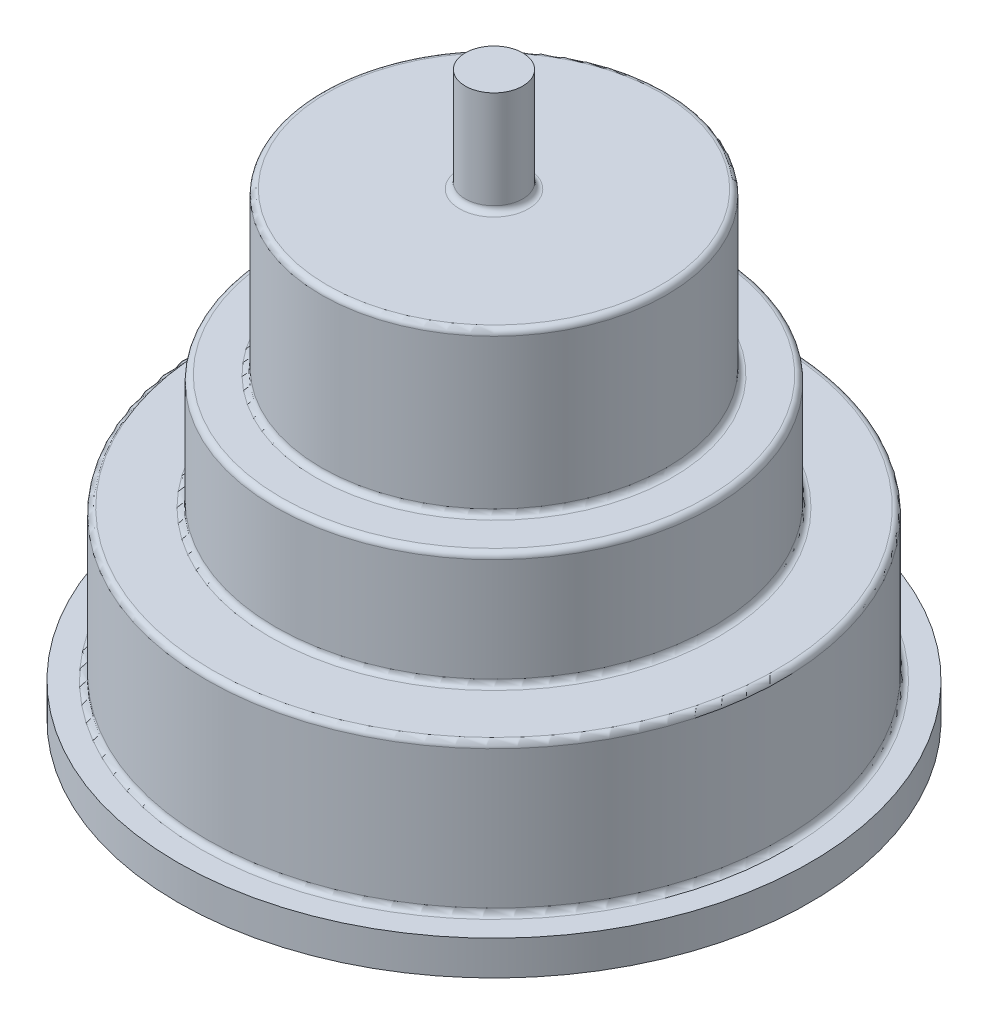
ISO-10303-21;
HEADER;
FILE_DESCRIPTION(('STEP AP214'),'2;1');
FILE_NAME('part.step','',(''),(''),'','','');
FILE_SCHEMA(('AUTOMOTIVE_DESIGN { 1 0 10303 214 1 1 1 1 }'));
ENDSEC;
DATA;
#1=APPLICATION_CONTEXT('core data for automotive mechanical design processes');
#2=APPLICATION_PROTOCOL_DEFINITION('international standard','automotive_design',2000,#1);
#3=PRODUCT_CONTEXT('',#1,'mechanical');
#4=PRODUCT('Part','Part','',(#3));
#5=PRODUCT_RELATED_PRODUCT_CATEGORY('part','',(#4));
#6=PRODUCT_DEFINITION_FORMATION('','',#4);
#7=PRODUCT_DEFINITION_CONTEXT('part definition',#1,'design');
#8=PRODUCT_DEFINITION('design','',#6,#7);
#9=PRODUCT_DEFINITION_SHAPE('','',#8);
#10=(LENGTH_UNIT() NAMED_UNIT(*) SI_UNIT(.MILLI.,.METRE.));
#11=(NAMED_UNIT(*) PLANE_ANGLE_UNIT() SI_UNIT($,.RADIAN.));
#12=(NAMED_UNIT(*) SI_UNIT($,.STERADIAN.) SOLID_ANGLE_UNIT());
#13=UNCERTAINTY_MEASURE_WITH_UNIT(LENGTH_MEASURE(1.E-05),#10,'distance_accuracy_value','');
#14=(GEOMETRIC_REPRESENTATION_CONTEXT(3) GLOBAL_UNCERTAINTY_ASSIGNED_CONTEXT((#13)) GLOBAL_UNIT_ASSIGNED_CONTEXT((#10,
#11,#12)) REPRESENTATION_CONTEXT('',''));
#15=CARTESIAN_POINT('',(0.,0.,0.));
#16=DIRECTION('',(0.,0.,1.));
#17=DIRECTION('',(1.,0.,0.));
#18=AXIS2_PLACEMENT_3D('',#15,#16,#17);
#19=CARTESIAN_POINT('',(0.,26.,0.));
#20=DIRECTION('',(0.,-1.,0.));
#21=DIRECTION('',(0.,0.,-1.));
#22=AXIS2_PLACEMENT_3D('',#19,#20,#21);
#23=CYLINDRICAL_SURFACE('',#22,25.);
#24=CARTESIAN_POINT('',(0.,15.5,0.));
#25=DIRECTION('',(0.,1.,0.));
#26=DIRECTION('',(0.,0.,1.));
#27=AXIS2_PLACEMENT_3D('',#24,#25,#26);
#28=CIRCLE('',#27,25.);
#29=CARTESIAN_POINT('',(0.,15.5,25.));
#30=VERTEX_POINT('',#29);
#31=EDGE_CURVE('E136',#30,#30,#28,.F.);
#32=ORIENTED_EDGE('',*,*,#31,.T.);
#33=EDGE_LOOP('',(#32));
#34=FACE_BOUND('',#33,.T.);
#35=CARTESIAN_POINT('',(0.,3.5,0.));
#36=DIRECTION('',(0.,1.,0.));
#37=DIRECTION('',(0.,0.,1.));
#38=AXIS2_PLACEMENT_3D('',#35,#36,#37);
#39=CIRCLE('',#38,25.);
#40=CARTESIAN_POINT('',(0.,3.5,25.));
#41=VERTEX_POINT('',#40);
#42=EDGE_CURVE('E133',#41,#41,#39,.T.);
#43=ORIENTED_EDGE('',*,*,#42,.T.);
#44=EDGE_LOOP('',(#43));
#45=FACE_BOUND('',#44,.T.);
#46=ADVANCED_FACE('F40',(#34,#45),#23,.T.);
#47=CARTESIAN_POINT('',(0.,3.,0.));
#48=DIRECTION('',(0.,-1.,0.));
#49=DIRECTION('',(0.,0.,-1.));
#50=AXIS2_PLACEMENT_3D('',#47,#48,#49);
#51=CYLINDRICAL_SURFACE('',#50,27.5);
#52=CARTESIAN_POINT('',(0.,3.,0.));
#53=DIRECTION('',(0.,1.,0.));
#54=DIRECTION('',(0.,0.,1.));
#55=AXIS2_PLACEMENT_3D('',#52,#53,#54);
#56=CIRCLE('',#55,27.5);
#57=CARTESIAN_POINT('',(0.,3.,27.5));
#58=VERTEX_POINT('',#57);
#59=EDGE_CURVE('E98',#58,#58,#56,.T.);
#60=ORIENTED_EDGE('',*,*,#59,.F.);
#61=EDGE_LOOP('',(#60));
#62=FACE_BOUND('',#61,.T.);
#63=CARTESIAN_POINT('',(0.,0.,0.));
#64=DIRECTION('',(0.,1.,0.));
#65=DIRECTION('',(0.,0.,1.));
#66=AXIS2_PLACEMENT_3D('',#63,#64,#65);
#67=CIRCLE('',#66,27.5);
#68=CARTESIAN_POINT('',(0.,0.,27.5));
#69=VERTEX_POINT('',#68);
#70=EDGE_CURVE('E97',#69,#69,#67,.T.);
#71=ORIENTED_EDGE('',*,*,#70,.T.);
#72=EDGE_LOOP('',(#71));
#73=FACE_BOUND('',#72,.T.);
#74=ADVANCED_FACE('F153',(#62,#73),#51,.T.);
#75=CARTESIAN_POINT('',(0.,3.,0.));
#76=DIRECTION('',(0.,1.,0.));
#77=DIRECTION('',(0.,0.,1.));
#78=AXIS2_PLACEMENT_3D('',#75,#76,#77);
#79=PLANE('',#78);
#80=CARTESIAN_POINT('',(0.,3.,0.));
#81=DIRECTION('',(0.,1.,0.));
#82=DIRECTION('',(0.,0.,1.));
#83=AXIS2_PLACEMENT_3D('',#80,#81,#82);
#84=CIRCLE('',#83,25.5);
#85=CARTESIAN_POINT('',(0.,3.,25.5));
#86=VERTEX_POINT('',#85);
#87=EDGE_CURVE('E48',#86,#86,#84,.F.);
#88=ORIENTED_EDGE('',*,*,#87,.T.);
#89=EDGE_LOOP('',(#88));
#90=FACE_BOUND('',#89,.T.);
#91=ORIENTED_EDGE('',*,*,#59,.T.);
#92=EDGE_LOOP('',(#91));
#93=FACE_BOUND('',#92,.T.);
#94=ADVANCED_FACE('F141',(#90,#93),#79,.T.);
#95=CARTESIAN_POINT('',(0.,0.,0.));
#96=DIRECTION('',(0.,1.,0.));
#97=DIRECTION('',(0.,0.,1.));
#98=AXIS2_PLACEMENT_3D('',#95,#96,#97);
#99=PLANE('',#98);
#100=CARTESIAN_POINT('',(0.,0.,17.));
#101=DIRECTION('',(0.,-1.,0.));
#102=DIRECTION('',(0.,0.,-1.));
#103=AXIS2_PLACEMENT_3D('',#100,#101,#102);
#104=CIRCLE('',#103,1.64999999999999);
#105=CARTESIAN_POINT('',(0.,0.,15.35));
#106=VERTEX_POINT('',#105);
#107=EDGE_CURVE('E72',#106,#106,#104,.T.);
#108=ORIENTED_EDGE('',*,*,#107,.F.);
#109=EDGE_LOOP('',(#108));
#110=FACE_BOUND('',#109,.T.);
#111=CARTESIAN_POINT('',(17.,0.,0.));
#112=DIRECTION('',(0.,-1.,0.));
#113=DIRECTION('',(0.,0.,-1.));
#114=AXIS2_PLACEMENT_3D('',#111,#112,#113);
#115=CIRCLE('',#114,1.64999999999999);
#116=CARTESIAN_POINT('',(17.,0.,-1.64999999999999));
#117=VERTEX_POINT('',#116);
#118=EDGE_CURVE('E71',#117,#117,#115,.T.);
#119=ORIENTED_EDGE('',*,*,#118,.F.);
#120=EDGE_LOOP('',(#119));
#121=FACE_BOUND('',#120,.T.);
#122=CARTESIAN_POINT('',(0.,0.,-17.));
#123=DIRECTION('',(0.,-1.,0.));
#124=DIRECTION('',(0.,0.,-1.));
#125=AXIS2_PLACEMENT_3D('',#122,#123,#124);
#126=CIRCLE('',#125,1.64999999999999);
#127=CARTESIAN_POINT('',(0.,0.,-18.65));
#128=VERTEX_POINT('',#127);
#129=EDGE_CURVE('E82',#128,#128,#126,.T.);
#130=ORIENTED_EDGE('',*,*,#129,.F.);
#131=EDGE_LOOP('',(#130));
#132=FACE_BOUND('',#131,.T.);
#133=CARTESIAN_POINT('',(-17.,0.,0.));
#134=DIRECTION('',(0.,-1.,0.));
#135=DIRECTION('',(0.,0.,-1.));
#136=AXIS2_PLACEMENT_3D('',#133,#134,#135);
#137=CIRCLE('',#136,1.64999999999999);
#138=CARTESIAN_POINT('',(-17.,0.,-1.64999999999999));
#139=VERTEX_POINT('',#138);
#140=EDGE_CURVE('E88',#139,#139,#137,.T.);
#141=ORIENTED_EDGE('',*,*,#140,.F.);
#142=EDGE_LOOP('',(#141));
#143=FACE_BOUND('',#142,.T.);
#144=ORIENTED_EDGE('',*,*,#70,.F.);
#145=EDGE_LOOP('',(#144));
#146=FACE_BOUND('',#145,.T.);
#147=ADVANCED_FACE('F167',(#110,#121,#132,#143,#146),#99,.F.);
#148=CARTESIAN_POINT('',(-17.,11.,0.));
#149=DIRECTION('',(0.,-1.,0.));
#150=DIRECTION('',(0.,0.,-1.));
#151=AXIS2_PLACEMENT_3D('',#148,#149,#150);
#152=CONICAL_SURFACE('',#151,1.65,1.02974425867665);
#153=CARTESIAN_POINT('',(-17.,11.9914200213955,0.));
#154=VERTEX_POINT('',#153);
#155=VERTEX_LOOP('',#154);
#156=FACE_BOUND('',#155,.T.);
#157=CARTESIAN_POINT('',(-17.,11.,0.));
#158=DIRECTION('',(0.,-1.,0.));
#159=DIRECTION('',(0.,0.,-1.));
#160=AXIS2_PLACEMENT_3D('',#157,#158,#159);
#161=CIRCLE('',#160,1.65);
#162=CARTESIAN_POINT('',(-17.,11.,-1.65));
#163=VERTEX_POINT('',#162);
#164=EDGE_CURVE('E91',#163,#163,#161,.T.);
#165=ORIENTED_EDGE('',*,*,#164,.T.);
#166=EDGE_LOOP('',(#165));
#167=FACE_BOUND('',#166,.T.);
#168=ADVANCED_FACE('F169',(#156,#167),#152,.F.);
#169=CARTESIAN_POINT('',(-17.,0.,0.));
#170=DIRECTION('',(0.,-1.,0.));
#171=DIRECTION('',(0.,0.,-1.));
#172=AXIS2_PLACEMENT_3D('',#169,#170,#171);
#173=CYLINDRICAL_SURFACE('',#172,1.64999999999999);
#174=ORIENTED_EDGE('',*,*,#164,.F.);
#175=EDGE_LOOP('',(#174));
#176=FACE_BOUND('',#175,.T.);
#177=ORIENTED_EDGE('',*,*,#140,.T.);
#178=EDGE_LOOP('',(#177));
#179=FACE_BOUND('',#178,.T.);
#180=ADVANCED_FACE('F219',(#176,#179),#173,.F.);
#181=CARTESIAN_POINT('',(0.,11.,-17.));
#182=DIRECTION('',(0.,-1.,0.));
#183=DIRECTION('',(0.,0.,-1.));
#184=AXIS2_PLACEMENT_3D('',#181,#182,#183);
#185=CONICAL_SURFACE('',#184,1.65,1.02974425867665);
#186=CARTESIAN_POINT('',(0.,11.9914200213955,-17.));
#187=VERTEX_POINT('',#186);
#188=VERTEX_LOOP('',#187);
#189=FACE_BOUND('',#188,.T.);
#190=CARTESIAN_POINT('',(0.,11.,-17.));
#191=DIRECTION('',(0.,-1.,0.));
#192=DIRECTION('',(0.,0.,-1.));
#193=AXIS2_PLACEMENT_3D('',#190,#191,#192);
#194=CIRCLE('',#193,1.65);
#195=CARTESIAN_POINT('',(0.,11.,-18.65));
#196=VERTEX_POINT('',#195);
#197=EDGE_CURVE('E85',#196,#196,#194,.T.);
#198=ORIENTED_EDGE('',*,*,#197,.T.);
#199=EDGE_LOOP('',(#198));
#200=FACE_BOUND('',#199,.T.);
#201=ADVANCED_FACE('F222',(#189,#200),#185,.F.);
#202=CARTESIAN_POINT('',(0.,0.,-17.));
#203=DIRECTION('',(0.,-1.,0.));
#204=DIRECTION('',(0.,0.,-1.));
#205=AXIS2_PLACEMENT_3D('',#202,#203,#204);
#206=CYLINDRICAL_SURFACE('',#205,1.64999999999999);
#207=ORIENTED_EDGE('',*,*,#197,.F.);
#208=EDGE_LOOP('',(#207));
#209=FACE_BOUND('',#208,.T.);
#210=ORIENTED_EDGE('',*,*,#129,.T.);
#211=EDGE_LOOP('',(#210));
#212=FACE_BOUND('',#211,.T.);
#213=ADVANCED_FACE('F226',(#209,#212),#206,.F.);
#214=CARTESIAN_POINT('',(17.,11.,0.));
#215=DIRECTION('',(0.,-1.,0.));
#216=DIRECTION('',(0.,0.,-1.));
#217=AXIS2_PLACEMENT_3D('',#214,#215,#216);
#218=CONICAL_SURFACE('',#217,1.65,1.02974425867665);
#219=CARTESIAN_POINT('',(17.,11.9914200213955,0.));
#220=VERTEX_POINT('',#219);
#221=VERTEX_LOOP('',#220);
#222=FACE_BOUND('',#221,.T.);
#223=CARTESIAN_POINT('',(17.,11.,0.));
#224=DIRECTION('',(0.,-1.,0.));
#225=DIRECTION('',(0.,0.,-1.));
#226=AXIS2_PLACEMENT_3D('',#223,#224,#225);
#227=CIRCLE('',#226,1.65);
#228=CARTESIAN_POINT('',(17.,11.,-1.65));
#229=VERTEX_POINT('',#228);
#230=EDGE_CURVE('E75',#229,#229,#227,.T.);
#231=ORIENTED_EDGE('',*,*,#230,.T.);
#232=EDGE_LOOP('',(#231));
#233=FACE_BOUND('',#232,.T.);
#234=ADVANCED_FACE('F229',(#222,#233),#218,.F.);
#235=CARTESIAN_POINT('',(17.,0.,0.));
#236=DIRECTION('',(0.,-1.,0.));
#237=DIRECTION('',(0.,0.,-1.));
#238=AXIS2_PLACEMENT_3D('',#235,#236,#237);
#239=CYLINDRICAL_SURFACE('',#238,1.65);
#240=ORIENTED_EDGE('',*,*,#230,.F.);
#241=EDGE_LOOP('',(#240));
#242=FACE_BOUND('',#241,.T.);
#243=ORIENTED_EDGE('',*,*,#118,.T.);
#244=EDGE_LOOP('',(#243));
#245=FACE_BOUND('',#244,.T.);
#246=ADVANCED_FACE('F65',(#242,#245),#239,.F.);
#247=CARTESIAN_POINT('',(0.,11.,17.));
#248=DIRECTION('',(0.,-1.,0.));
#249=DIRECTION('',(0.,0.,-1.));
#250=AXIS2_PLACEMENT_3D('',#247,#248,#249);
#251=CONICAL_SURFACE('',#250,1.65,1.02974425867665);
#252=CARTESIAN_POINT('',(0.,11.9914200213955,17.));
#253=VERTEX_POINT('',#252);
#254=VERTEX_LOOP('',#253);
#255=FACE_BOUND('',#254,.T.);
#256=CARTESIAN_POINT('',(0.,11.,17.));
#257=DIRECTION('',(0.,-1.,0.));
#258=DIRECTION('',(0.,0.,-1.));
#259=AXIS2_PLACEMENT_3D('',#256,#257,#258);
#260=CIRCLE('',#259,1.65);
#261=CARTESIAN_POINT('',(0.,11.,15.35));
#262=VERTEX_POINT('',#261);
#263=EDGE_CURVE('E69',#262,#262,#260,.T.);
#264=ORIENTED_EDGE('',*,*,#263,.T.);
#265=EDGE_LOOP('',(#264));
#266=FACE_BOUND('',#265,.T.);
#267=ADVANCED_FACE('F61',(#255,#266),#251,.F.);
#268=CARTESIAN_POINT('',(0.,0.,17.));
#269=DIRECTION('',(0.,-1.,0.));
#270=DIRECTION('',(0.,0.,-1.));
#271=AXIS2_PLACEMENT_3D('',#268,#269,#270);
#272=CYLINDRICAL_SURFACE('',#271,1.64999999999999);
#273=ORIENTED_EDGE('',*,*,#263,.F.);
#274=EDGE_LOOP('',(#273));
#275=FACE_BOUND('',#274,.T.);
#276=ORIENTED_EDGE('',*,*,#107,.T.);
#277=EDGE_LOOP('',(#276));
#278=FACE_BOUND('',#277,.T.);
#279=ADVANCED_FACE('F64',(#275,#278),#272,.F.);
#280=CARTESIAN_POINT('',(0.,-67.7106781186548,0.));
#281=DIRECTION('',(0.,1.,0.));
#282=DIRECTION('',(0.,0.,1.));
#283=AXIS2_PLACEMENT_3D('',#280,#281,#282);
#284=CYLINDRICAL_SURFACE('',#283,19.);
#285=CARTESIAN_POINT('',(0.,16.5,0.));
#286=DIRECTION('',(0.,1.,0.));
#287=DIRECTION('',(0.,0.,1.));
#288=AXIS2_PLACEMENT_3D('',#285,#286,#287);
#289=CIRCLE('',#288,19.);
#290=CARTESIAN_POINT('',(0.,16.5,19.));
#291=VERTEX_POINT('',#290);
#292=EDGE_CURVE('E112',#291,#291,#289,.T.);
#293=ORIENTED_EDGE('',*,*,#292,.T.);
#294=EDGE_LOOP('',(#293));
#295=FACE_BOUND('',#294,.T.);
#296=CARTESIAN_POINT('',(0.,25.5,0.));
#297=DIRECTION('',(0.,1.,0.));
#298=DIRECTION('',(0.,0.,1.));
#299=AXIS2_PLACEMENT_3D('',#296,#297,#298);
#300=CIRCLE('',#299,19.);
#301=CARTESIAN_POINT('',(0.,25.5,19.));
#302=VERTEX_POINT('',#301);
#303=EDGE_CURVE('E109',#302,#302,#300,.F.);
#304=ORIENTED_EDGE('',*,*,#303,.T.);
#305=EDGE_LOOP('',(#304));
#306=FACE_BOUND('',#305,.T.);
#307=ADVANCED_FACE('F239',(#295,#306),#284,.T.);
#308=CARTESIAN_POINT('',(0.,16.,0.));
#309=DIRECTION('',(0.,1.,0.));
#310=DIRECTION('',(0.,0.,1.));
#311=AXIS2_PLACEMENT_3D('',#308,#309,#310);
#312=PLANE('',#311);
#313=CARTESIAN_POINT('',(0.,16.,0.));
#314=DIRECTION('',(0.,1.,0.));
#315=DIRECTION('',(0.,0.,1.));
#316=AXIS2_PLACEMENT_3D('',#313,#314,#315);
#317=CIRCLE('',#316,19.5);
#318=CARTESIAN_POINT('',(0.,16.,19.5));
#319=VERTEX_POINT('',#318);
#320=EDGE_CURVE('E106',#319,#319,#317,.F.);
#321=ORIENTED_EDGE('',*,*,#320,.T.);
#322=EDGE_LOOP('',(#321));
#323=FACE_BOUND('',#322,.T.);
#324=CARTESIAN_POINT('',(0.,16.,0.));
#325=DIRECTION('',(0.,1.,0.));
#326=DIRECTION('',(0.,0.,1.));
#327=AXIS2_PLACEMENT_3D('',#324,#325,#326);
#328=CIRCLE('',#327,24.5);
#329=CARTESIAN_POINT('',(0.,16.,24.5));
#330=VERTEX_POINT('',#329);
#331=EDGE_CURVE('E101',#330,#330,#328,.T.);
#332=ORIENTED_EDGE('',*,*,#331,.T.);
#333=EDGE_LOOP('',(#332));
#334=FACE_BOUND('',#333,.T.);
#335=ADVANCED_FACE('F215',(#323,#334),#312,.T.);
#336=CARTESIAN_POINT('',(0.,49.,0.));
#337=DIRECTION('',(0.,1.,0.));
#338=DIRECTION('',(0.,0.,1.));
#339=AXIS2_PLACEMENT_3D('',#336,#337,#338);
#340=PLANE('',#339);
#341=CARTESIAN_POINT('',(0.,49.,0.));
#342=DIRECTION('',(0.,1.,0.));
#343=DIRECTION('',(0.,0.,1.));
#344=AXIS2_PLACEMENT_3D('',#341,#342,#343);
#345=CIRCLE('',#344,2.5);
#346=CARTESIAN_POINT('',(0.,49.,2.5));
#347=VERTEX_POINT('',#346);
#348=EDGE_CURVE('E94',#347,#347,#345,.T.);
#349=ORIENTED_EDGE('',*,*,#348,.T.);
#350=EDGE_LOOP('',(#349));
#351=FACE_BOUND('',#350,.T.);
#352=ADVANCED_FACE('F211',(#351),#340,.T.);
#353=CARTESIAN_POINT('',(0.,49.,0.));
#354=DIRECTION('',(0.,-1.,0.));
#355=DIRECTION('',(0.,0.,-1.));
#356=AXIS2_PLACEMENT_3D('',#353,#354,#355);
#357=CYLINDRICAL_SURFACE('',#356,2.5);
#358=CARTESIAN_POINT('',(0.,40.5,0.));
#359=DIRECTION('',(0.,1.,0.));
#360=DIRECTION('',(0.,0.,1.));
#361=AXIS2_PLACEMENT_3D('',#358,#359,#360);
#362=CIRCLE('',#361,2.5);
#363=CARTESIAN_POINT('',(0.,40.5,2.5));
#364=VERTEX_POINT('',#363);
#365=EDGE_CURVE('E13',#364,#364,#362,.T.);
#366=ORIENTED_EDGE('',*,*,#365,.T.);
#367=EDGE_LOOP('',(#366));
#368=FACE_BOUND('',#367,.T.);
#369=ORIENTED_EDGE('',*,*,#348,.F.);
#370=EDGE_LOOP('',(#369));
#371=FACE_BOUND('',#370,.T.);
#372=ADVANCED_FACE('F205',(#368,#371),#357,.T.);
#373=CARTESIAN_POINT('',(0.,40.,0.));
#374=DIRECTION('',(0.,1.,0.));
#375=DIRECTION('',(0.,0.,1.));
#376=AXIS2_PLACEMENT_3D('',#373,#374,#375);
#377=PLANE('',#376);
#378=CARTESIAN_POINT('',(0.,40.,0.));
#379=DIRECTION('',(0.,1.,0.));
#380=DIRECTION('',(0.,0.,1.));
#381=AXIS2_PLACEMENT_3D('',#378,#379,#380);
#382=CIRCLE('',#381,14.5);
#383=CARTESIAN_POINT('',(0.,40.,14.5));
#384=VERTEX_POINT('',#383);
#385=EDGE_CURVE('E118',#384,#384,#382,.T.);
#386=ORIENTED_EDGE('',*,*,#385,.T.);
#387=EDGE_LOOP('',(#386));
#388=FACE_BOUND('',#387,.T.);
#389=CARTESIAN_POINT('',(0.,40.,0.));
#390=DIRECTION('',(0.,1.,0.));
#391=DIRECTION('',(0.,0.,1.));
#392=AXIS2_PLACEMENT_3D('',#389,#390,#391);
#393=CIRCLE('',#392,3.);
#394=CARTESIAN_POINT('',(0.,40.,3.));
#395=VERTEX_POINT('',#394);
#396=EDGE_CURVE('E115',#395,#395,#393,.F.);
#397=ORIENTED_EDGE('',*,*,#396,.T.);
#398=EDGE_LOOP('',(#397));
#399=FACE_BOUND('',#398,.T.);
#400=ADVANCED_FACE('F198',(#388,#399),#377,.T.);
#401=CARTESIAN_POINT('',(0.,40.,0.));
#402=DIRECTION('',(0.,-1.,0.));
#403=DIRECTION('',(0.,0.,-1.));
#404=AXIS2_PLACEMENT_3D('',#401,#402,#403);
#405=CYLINDRICAL_SURFACE('',#404,15.);
#406=CARTESIAN_POINT('',(0.,39.5,0.));
#407=DIRECTION('',(0.,1.,0.));
#408=DIRECTION('',(0.,0.,1.));
#409=AXIS2_PLACEMENT_3D('',#406,#407,#408);
#410=CIRCLE('',#409,15.);
#411=CARTESIAN_POINT('',(0.,39.5,15.));
#412=VERTEX_POINT('',#411);
#413=EDGE_CURVE('E124',#412,#412,#410,.F.);
#414=ORIENTED_EDGE('',*,*,#413,.T.);
#415=EDGE_LOOP('',(#414));
#416=FACE_BOUND('',#415,.T.);
#417=CARTESIAN_POINT('',(0.,26.5,0.));
#418=DIRECTION('',(0.,1.,0.));
#419=DIRECTION('',(0.,0.,1.));
#420=AXIS2_PLACEMENT_3D('',#417,#418,#419);
#421=CIRCLE('',#420,15.);
#422=CARTESIAN_POINT('',(0.,26.5,15.));
#423=VERTEX_POINT('',#422);
#424=EDGE_CURVE('E121',#423,#423,#421,.T.);
#425=ORIENTED_EDGE('',*,*,#424,.T.);
#426=EDGE_LOOP('',(#425));
#427=FACE_BOUND('',#426,.T.);
#428=ADVANCED_FACE('F196',(#416,#427),#405,.T.);
#429=CARTESIAN_POINT('',(0.,26.,0.));
#430=DIRECTION('',(0.,1.,0.));
#431=DIRECTION('',(0.,0.,1.));
#432=AXIS2_PLACEMENT_3D('',#429,#430,#431);
#433=PLANE('',#432);
#434=CARTESIAN_POINT('',(0.,26.,0.));
#435=DIRECTION('',(0.,1.,0.));
#436=DIRECTION('',(0.,0.,1.));
#437=AXIS2_PLACEMENT_3D('',#434,#435,#436);
#438=CIRCLE('',#437,18.5);
#439=CARTESIAN_POINT('',(0.,26.,18.5));
#440=VERTEX_POINT('',#439);
#441=EDGE_CURVE('E130',#440,#440,#438,.T.);
#442=ORIENTED_EDGE('',*,*,#441,.T.);
#443=EDGE_LOOP('',(#442));
#444=FACE_BOUND('',#443,.T.);
#445=CARTESIAN_POINT('',(0.,26.,0.));
#446=DIRECTION('',(0.,1.,0.));
#447=DIRECTION('',(0.,0.,1.));
#448=AXIS2_PLACEMENT_3D('',#445,#446,#447);
#449=CIRCLE('',#448,15.5);
#450=CARTESIAN_POINT('',(0.,26.,15.5));
#451=VERTEX_POINT('',#450);
#452=EDGE_CURVE('E127',#451,#451,#449,.F.);
#453=ORIENTED_EDGE('',*,*,#452,.T.);
#454=EDGE_LOOP('',(#453));
#455=FACE_BOUND('',#454,.T.);
#456=ADVANCED_FACE('F163',(#444,#455),#433,.T.);
#457=CARTESIAN_POINT('',(0.,16.5,0.));
#458=DIRECTION('',(0.,1.,0.));
#459=DIRECTION('',(0.,0.,1.));
#460=AXIS2_PLACEMENT_3D('',#457,#458,#459);
#461=TOROIDAL_SURFACE('',#460,19.5,0.5);
#462=ORIENTED_EDGE('',*,*,#292,.F.);
#463=EDGE_LOOP('',(#462));
#464=FACE_BOUND('',#463,.T.);
#465=ORIENTED_EDGE('',*,*,#320,.F.);
#466=EDGE_LOOP('',(#465));
#467=FACE_BOUND('',#466,.T.);
#468=ADVANCED_FACE('F172',(#464,#467),#461,.F.);
#469=CARTESIAN_POINT('',(0.,39.5,0.));
#470=DIRECTION('',(0.,1.,0.));
#471=DIRECTION('',(0.,0.,1.));
#472=AXIS2_PLACEMENT_3D('',#469,#470,#471);
#473=TOROIDAL_SURFACE('',#472,14.5,0.5);
#474=ORIENTED_EDGE('',*,*,#413,.F.);
#475=EDGE_LOOP('',(#474));
#476=FACE_BOUND('',#475,.T.);
#477=ORIENTED_EDGE('',*,*,#385,.F.);
#478=EDGE_LOOP('',(#477));
#479=FACE_BOUND('',#478,.T.);
#480=ADVANCED_FACE('F175',(#476,#479),#473,.T.);
#481=CARTESIAN_POINT('',(0.,25.5,0.));
#482=DIRECTION('',(0.,1.,0.));
#483=DIRECTION('',(0.,0.,1.));
#484=AXIS2_PLACEMENT_3D('',#481,#482,#483);
#485=TOROIDAL_SURFACE('',#484,18.5,0.5);
#486=ORIENTED_EDGE('',*,*,#303,.F.);
#487=EDGE_LOOP('',(#486));
#488=FACE_BOUND('',#487,.T.);
#489=ORIENTED_EDGE('',*,*,#441,.F.);
#490=EDGE_LOOP('',(#489));
#491=FACE_BOUND('',#490,.T.);
#492=ADVANCED_FACE('F179',(#488,#491),#485,.T.);
#493=CARTESIAN_POINT('',(0.,15.5,0.));
#494=DIRECTION('',(0.,1.,0.));
#495=DIRECTION('',(0.,0.,1.));
#496=AXIS2_PLACEMENT_3D('',#493,#494,#495);
#497=TOROIDAL_SURFACE('',#496,24.5,0.5);
#498=ORIENTED_EDGE('',*,*,#331,.F.);
#499=EDGE_LOOP('',(#498));
#500=FACE_BOUND('',#499,.T.);
#501=ORIENTED_EDGE('',*,*,#31,.F.);
#502=EDGE_LOOP('',(#501));
#503=FACE_BOUND('',#502,.T.);
#504=ADVANCED_FACE('F148',(#500,#503),#497,.T.);
#505=CARTESIAN_POINT('',(0.,3.5,0.));
#506=DIRECTION('',(0.,1.,0.));
#507=DIRECTION('',(0.,0.,1.));
#508=AXIS2_PLACEMENT_3D('',#505,#506,#507);
#509=TOROIDAL_SURFACE('',#508,25.5,0.5);
#510=ORIENTED_EDGE('',*,*,#87,.F.);
#511=EDGE_LOOP('',(#510));
#512=FACE_BOUND('',#511,.T.);
#513=ORIENTED_EDGE('',*,*,#42,.F.);
#514=EDGE_LOOP('',(#513));
#515=FACE_BOUND('',#514,.T.);
#516=ADVANCED_FACE('F144',(#512,#515),#509,.F.);
#517=CARTESIAN_POINT('',(0.,26.5,0.));
#518=DIRECTION('',(0.,1.,0.));
#519=DIRECTION('',(0.,0.,1.));
#520=AXIS2_PLACEMENT_3D('',#517,#518,#519);
#521=TOROIDAL_SURFACE('',#520,15.5,0.5);
#522=ORIENTED_EDGE('',*,*,#452,.F.);
#523=EDGE_LOOP('',(#522));
#524=FACE_BOUND('',#523,.T.);
#525=ORIENTED_EDGE('',*,*,#424,.F.);
#526=EDGE_LOOP('',(#525));
#527=FACE_BOUND('',#526,.T.);
#528=ADVANCED_FACE('F147',(#524,#527),#521,.F.);
#529=CARTESIAN_POINT('',(0.,40.5,0.));
#530=DIRECTION('',(0.,1.,0.));
#531=DIRECTION('',(0.,0.,1.));
#532=AXIS2_PLACEMENT_3D('',#529,#530,#531);
#533=TOROIDAL_SURFACE('',#532,3.,0.5);
#534=ORIENTED_EDGE('',*,*,#396,.F.);
#535=EDGE_LOOP('',(#534));
#536=FACE_BOUND('',#535,.T.);
#537=ORIENTED_EDGE('',*,*,#365,.F.);
#538=EDGE_LOOP('',(#537));
#539=FACE_BOUND('',#538,.T.);
#540=ADVANCED_FACE('F42',(#536,#539),#533,.F.);
#541=CLOSED_SHELL('',(#46,#74,#94,#147,#168,#180,#201,#213,#234,#246,#267,#279,#307,#335,#352,
#372,#400,#428,#456,#468,#480,#492,#504,#516,#528,#540));
#542=MANIFOLD_SOLID_BREP('B2',#541);
#543=ADVANCED_BREP_SHAPE_REPRESENTATION('',(#18,#542),#14);
#544=SHAPE_DEFINITION_REPRESENTATION(#9,#543);
ENDSEC;
END-ISO-10303-21;
